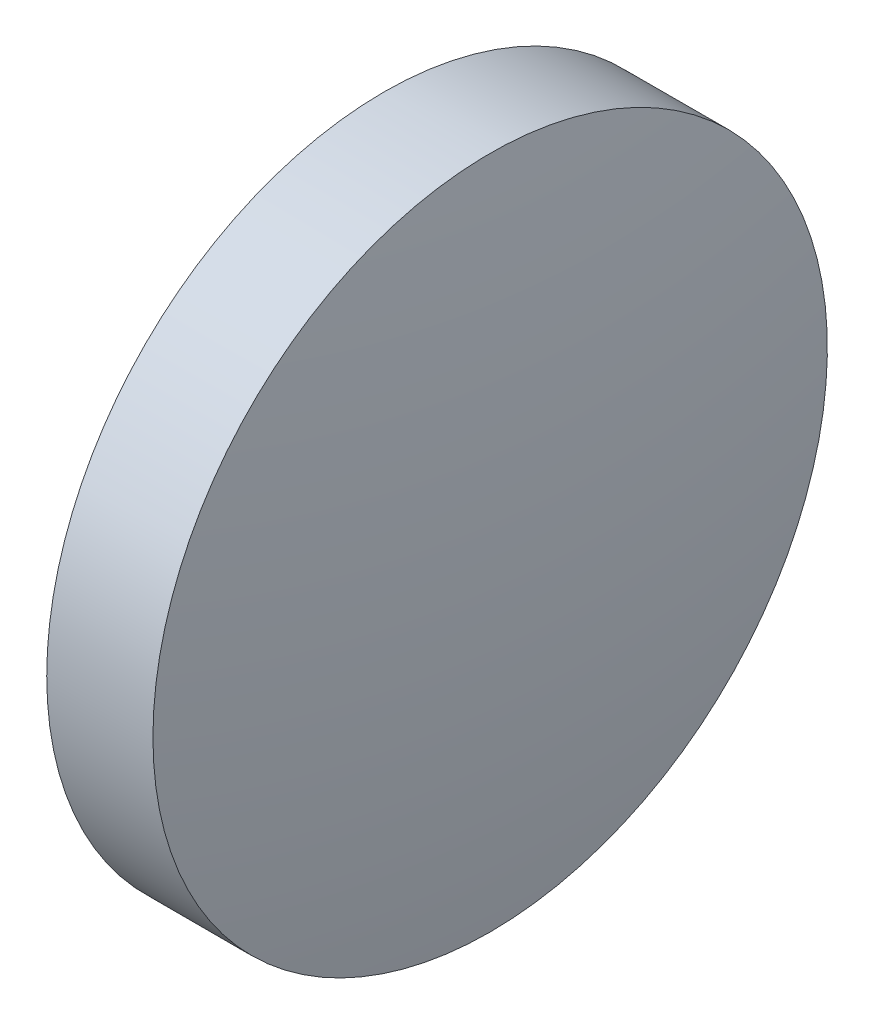
ISO-10303-21;
HEADER;
FILE_DESCRIPTION(('STEP AP214'),'2;1');
FILE_NAME('part.step','',(''),(''),'','','');
FILE_SCHEMA(('AUTOMOTIVE_DESIGN { 1 0 10303 214 1 1 1 1 }'));
ENDSEC;
DATA;
#1=APPLICATION_CONTEXT('core data for automotive mechanical design processes');
#2=APPLICATION_PROTOCOL_DEFINITION('international standard','automotive_design',2000,#1);
#3=PRODUCT_CONTEXT('',#1,'mechanical');
#4=PRODUCT('Part','Part','',(#3));
#5=PRODUCT_RELATED_PRODUCT_CATEGORY('part','',(#4));
#6=PRODUCT_DEFINITION_FORMATION('','',#4);
#7=PRODUCT_DEFINITION_CONTEXT('part definition',#1,'design');
#8=PRODUCT_DEFINITION('design','',#6,#7);
#9=PRODUCT_DEFINITION_SHAPE('','',#8);
#10=(LENGTH_UNIT() NAMED_UNIT(*) SI_UNIT(.MILLI.,.METRE.));
#11=(NAMED_UNIT(*) PLANE_ANGLE_UNIT() SI_UNIT($,.RADIAN.));
#12=(NAMED_UNIT(*) SI_UNIT($,.STERADIAN.) SOLID_ANGLE_UNIT());
#13=UNCERTAINTY_MEASURE_WITH_UNIT(LENGTH_MEASURE(1.E-05),#10,'distance_accuracy_value','');
#14=(GEOMETRIC_REPRESENTATION_CONTEXT(3) GLOBAL_UNCERTAINTY_ASSIGNED_CONTEXT((#13)) GLOBAL_UNIT_ASSIGNED_CONTEXT((#10,
#11,#12)) REPRESENTATION_CONTEXT('',''));
#15=CARTESIAN_POINT('',(0.,0.,0.));
#16=DIRECTION('',(0.,0.,1.));
#17=DIRECTION('',(1.,0.,0.));
#18=AXIS2_PLACEMENT_3D('',#15,#16,#17);
#19=CARTESIAN_POINT('',(82.3045883751492,24.3080565115924,0.));
#20=DIRECTION('',(-1.,0.,0.));
#21=DIRECTION('',(0.,1.,0.));
#22=AXIS2_PLACEMENT_3D('',#19,#20,#21);
#23=SPHERICAL_SURFACE('',#22,40.5754884878179);
#24=CARTESIAN_POINT('',(42.229062601617,24.3080565115924,0.));
#25=DIRECTION('',(-1.,0.,0.));
#26=DIRECTION('',(0.,0.,1.));
#27=AXIS2_PLACEMENT_3D('',#24,#25,#26);
#28=CIRCLE('',#27,6.35);
#29=CARTESIAN_POINT('',(42.229062601617,24.3080565115924,6.35));
#30=VERTEX_POINT('',#29);
#31=EDGE_CURVE('E46',#30,#30,#28,.T.);
#32=ORIENTED_EDGE('',*,*,#31,.T.);
#33=EDGE_LOOP('',(#32));
#34=FACE_BOUND('',#33,.T.);
#35=ADVANCED_FACE('F39',(#34),#23,.T.);
#36=CARTESIAN_POINT('',(4.15360539951404,24.3080565115924,0.));
#37=DIRECTION('',(-1.,0.,0.));
#38=DIRECTION('',(0.,-1.,0.));
#39=AXIS2_PLACEMENT_3D('',#36,#37,#38);
#40=SPHERICAL_SURFACE('',#39,40.5754884878172);
#41=CARTESIAN_POINT('',(44.2291311730456,24.3080565115924,0.));
#42=DIRECTION('',(-1.,0.,0.));
#43=DIRECTION('',(0.,0.,1.));
#44=AXIS2_PLACEMENT_3D('',#41,#42,#43);
#45=CIRCLE('',#44,6.35);
#46=CARTESIAN_POINT('',(44.2291311730456,24.3080565115924,6.35));
#47=VERTEX_POINT('',#46);
#48=EDGE_CURVE('E10',#47,#47,#45,.T.);
#49=ORIENTED_EDGE('',*,*,#48,.F.);
#50=EDGE_LOOP('',(#49));
#51=FACE_BOUND('',#50,.T.);
#52=ADVANCED_FACE('F56',(#51),#40,.T.);
#53=CARTESIAN_POINT('',(39.6527006754186,24.3080565115924,0.));
#54=DIRECTION('',(-1.,0.,0.));
#55=DIRECTION('',(0.,0.,1.));
#56=AXIS2_PLACEMENT_3D('',#53,#54,#55);
#57=CYLINDRICAL_SURFACE('',#56,6.35);
#58=ORIENTED_EDGE('',*,*,#48,.T.);
#59=EDGE_LOOP('',(#58));
#60=FACE_BOUND('',#59,.T.);
#61=ORIENTED_EDGE('',*,*,#31,.F.);
#62=EDGE_LOOP('',(#61));
#63=FACE_BOUND('',#62,.T.);
#64=ADVANCED_FACE('F54',(#60,#63),#57,.T.);
#65=CLOSED_SHELL('',(#35,#52,#64));
#66=MANIFOLD_SOLID_BREP('B2',#65);
#67=ADVANCED_BREP_SHAPE_REPRESENTATION('',(#18,#66),#14);
#68=SHAPE_DEFINITION_REPRESENTATION(#9,#67);
ENDSEC;
END-ISO-10303-21;
